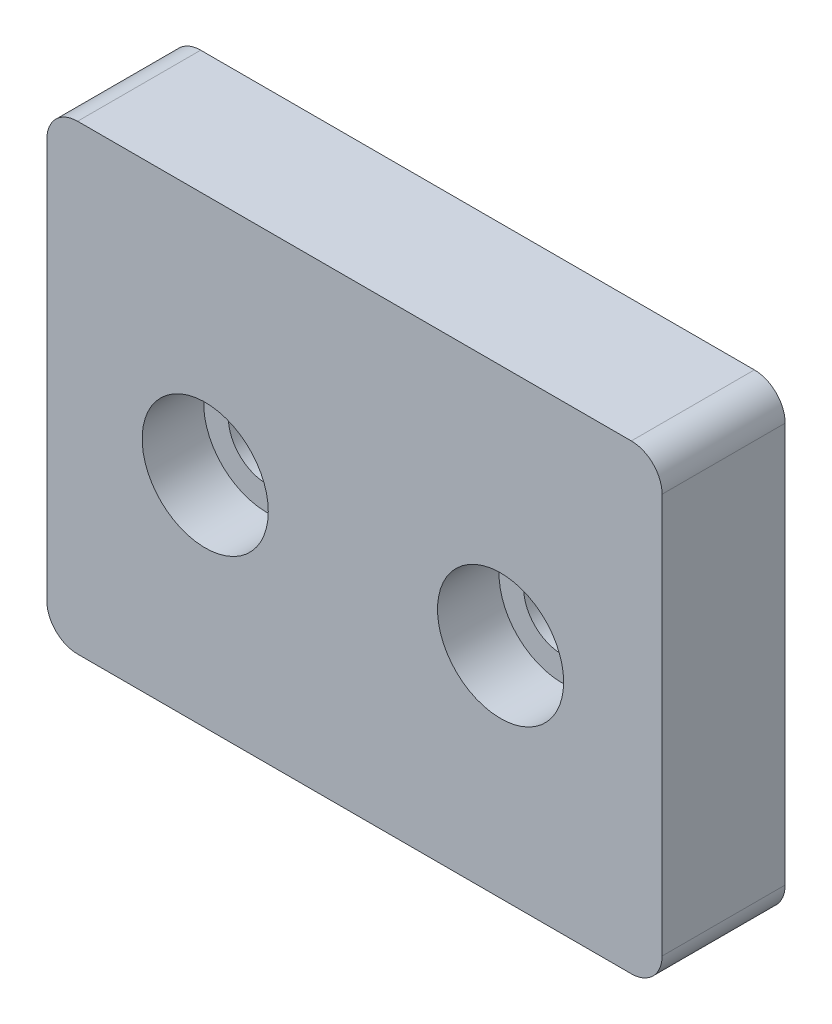
ISO-10303-21;
HEADER;
FILE_DESCRIPTION(('STEP AP214'),'2;1');
FILE_NAME('part.step','',(''),(''),'','','');
FILE_SCHEMA(('AUTOMOTIVE_DESIGN { 1 0 10303 214 1 1 1 1 }'));
ENDSEC;
DATA;
#1=APPLICATION_CONTEXT('core data for automotive mechanical design processes');
#2=APPLICATION_PROTOCOL_DEFINITION('international standard','automotive_design',2000,#1);
#3=PRODUCT_CONTEXT('',#1,'mechanical');
#4=PRODUCT('Part','Part','',(#3));
#5=PRODUCT_RELATED_PRODUCT_CATEGORY('part','',(#4));
#6=PRODUCT_DEFINITION_FORMATION('','',#4);
#7=PRODUCT_DEFINITION_CONTEXT('part definition',#1,'design');
#8=PRODUCT_DEFINITION('design','',#6,#7);
#9=PRODUCT_DEFINITION_SHAPE('','',#8);
#10=(LENGTH_UNIT() NAMED_UNIT(*) SI_UNIT(.MILLI.,.METRE.));
#11=(NAMED_UNIT(*) PLANE_ANGLE_UNIT() SI_UNIT($,.RADIAN.));
#12=(NAMED_UNIT(*) SI_UNIT($,.STERADIAN.) SOLID_ANGLE_UNIT());
#13=UNCERTAINTY_MEASURE_WITH_UNIT(LENGTH_MEASURE(1.E-05),#10,'distance_accuracy_value','');
#14=(GEOMETRIC_REPRESENTATION_CONTEXT(3) GLOBAL_UNCERTAINTY_ASSIGNED_CONTEXT((#13)) GLOBAL_UNIT_ASSIGNED_CONTEXT((#10,
#11,#12)) REPRESENTATION_CONTEXT('',''));
#15=CARTESIAN_POINT('',(0.,0.,0.));
#16=DIRECTION('',(0.,0.,1.));
#17=DIRECTION('',(1.,0.,0.));
#18=AXIS2_PLACEMENT_3D('',#15,#16,#17);
#19=CARTESIAN_POINT('',(4.74874158909593,-1.24229421046024,4.));
#20=DIRECTION('',(0.,0.,-1.));
#21=DIRECTION('',(-1.,0.,0.));
#22=AXIS2_PLACEMENT_3D('',#19,#20,#21);
#23=CYLINDRICAL_SURFACE('',#22,1.25);
#24=CARTESIAN_POINT('',(4.74874158909593,-1.24229421046024,0.));
#25=DIRECTION('',(0.,0.,1.));
#26=DIRECTION('',(1.,0.,0.));
#27=AXIS2_PLACEMENT_3D('',#24,#25,#26);
#28=CIRCLE('',#27,1.25);
#29=CARTESIAN_POINT('',(5.99874158909593,-1.24229421046024,0.));
#30=VERTEX_POINT('',#29);
#31=EDGE_CURVE('E171',#30,#30,#28,.T.);
#32=ORIENTED_EDGE('',*,*,#31,.F.);
#33=EDGE_LOOP('',(#32));
#34=FACE_BOUND('',#33,.T.);
#35=CARTESIAN_POINT('',(4.74874158909593,-1.24229421046024,2.));
#36=DIRECTION('',(0.,0.,1.));
#37=DIRECTION('',(1.,0.,0.));
#38=AXIS2_PLACEMENT_3D('',#35,#36,#37);
#39=CIRCLE('',#38,1.25);
#40=CARTESIAN_POINT('',(5.99874158909593,-1.24229421046024,2.));
#41=VERTEX_POINT('',#40);
#42=EDGE_CURVE('E137',#41,#41,#39,.T.);
#43=ORIENTED_EDGE('',*,*,#42,.T.);
#44=EDGE_LOOP('',(#43));
#45=FACE_BOUND('',#44,.T.);
#46=ADVANCED_FACE('F32',(#34,#45),#23,.F.);
#47=CARTESIAN_POINT('',(-4.85125841090407,-1.24229421046024,4.));
#48=DIRECTION('',(0.,0.,-1.));
#49=DIRECTION('',(-1.,0.,0.));
#50=AXIS2_PLACEMENT_3D('',#47,#48,#49);
#51=CYLINDRICAL_SURFACE('',#50,1.25);
#52=CARTESIAN_POINT('',(-4.85125841090407,-1.24229421046024,0.));
#53=DIRECTION('',(0.,0.,1.));
#54=DIRECTION('',(1.,0.,0.));
#55=AXIS2_PLACEMENT_3D('',#52,#53,#54);
#56=CIRCLE('',#55,1.25);
#57=CARTESIAN_POINT('',(-3.60125841090407,-1.24229421046024,0.));
#58=VERTEX_POINT('',#57);
#59=EDGE_CURVE('E141',#58,#58,#56,.T.);
#60=ORIENTED_EDGE('',*,*,#59,.F.);
#61=EDGE_LOOP('',(#60));
#62=FACE_BOUND('',#61,.T.);
#63=CARTESIAN_POINT('',(-4.85125841090407,-1.24229421046024,2.));
#64=DIRECTION('',(0.,0.,1.));
#65=DIRECTION('',(1.,0.,0.));
#66=AXIS2_PLACEMENT_3D('',#63,#64,#65);
#67=CIRCLE('',#66,1.25);
#68=CARTESIAN_POINT('',(-3.60125841090407,-1.24229421046024,2.));
#69=VERTEX_POINT('',#68);
#70=EDGE_CURVE('E134',#69,#69,#67,.T.);
#71=ORIENTED_EDGE('',*,*,#70,.T.);
#72=EDGE_LOOP('',(#71));
#73=FACE_BOUND('',#72,.T.);
#74=ADVANCED_FACE('F206',(#62,#73),#51,.F.);
#75=CARTESIAN_POINT('',(0.,0.,4.));
#76=DIRECTION('',(0.,0.,-1.));
#77=DIRECTION('',(-1.,0.,0.));
#78=AXIS2_PLACEMENT_3D('',#75,#76,#77);
#79=PLANE('',#78);
#80=CARTESIAN_POINT('',(-4.85125841090407,-1.24229421046024,4.));
#81=DIRECTION('',(0.,0.,1.));
#82=DIRECTION('',(1.,0.,0.));
#83=AXIS2_PLACEMENT_3D('',#80,#81,#82);
#84=CIRCLE('',#83,2.05);
#85=CARTESIAN_POINT('',(-2.80125841090407,-1.24229421046024,4.));
#86=VERTEX_POINT('',#85);
#87=EDGE_CURVE('E189',#86,#86,#84,.T.);
#88=ORIENTED_EDGE('',*,*,#87,.F.);
#89=EDGE_LOOP('',(#88));
#90=FACE_BOUND('',#89,.T.);
#91=CARTESIAN_POINT('',(4.74874158909593,-1.24229421046024,4.));
#92=DIRECTION('',(0.,0.,1.));
#93=DIRECTION('',(1.,0.,0.));
#94=AXIS2_PLACEMENT_3D('',#91,#92,#93);
#95=CIRCLE('',#94,2.05);
#96=CARTESIAN_POINT('',(6.79874158909593,-1.24229421046024,4.));
#97=VERTEX_POINT('',#96);
#98=EDGE_CURVE('E183',#97,#97,#95,.T.);
#99=ORIENTED_EDGE('',*,*,#98,.F.);
#100=EDGE_LOOP('',(#99));
#101=FACE_BOUND('',#100,.T.);
#102=DIRECTION('',(0.,-1.,0.));
#103=VECTOR('',#102,1.);
#104=CARTESIAN_POINT('',(-9.99874158909593,6.64564965687844,4.));
#105=LINE('',#104,#103);
#106=CARTESIAN_POINT('',(-9.99874158909593,5.64564965687844,4.));
#107=VERTEX_POINT('',#106);
#108=CARTESIAN_POINT('',(-9.99874158909593,-7.35435034312156,4.));
#109=VERTEX_POINT('',#108);
#110=EDGE_CURVE('E177',#107,#109,#105,.T.);
#111=ORIENTED_EDGE('',*,*,#110,.T.);
#112=CARTESIAN_POINT('',(-8.99874158909593,-7.35435034312156,4.));
#113=DIRECTION('',(0.,0.,-1.));
#114=DIRECTION('',(-1.,0.,0.));
#115=AXIS2_PLACEMENT_3D('',#112,#113,#114);
#116=CIRCLE('',#115,1.);
#117=CARTESIAN_POINT('',(-8.99874158909593,-8.35435034312156,4.));
#118=VERTEX_POINT('',#117);
#119=EDGE_CURVE('E155',#109,#118,#116,.F.);
#120=ORIENTED_EDGE('',*,*,#119,.T.);
#121=DIRECTION('',(1.,0.,0.));
#122=VECTOR('',#121,1.);
#123=CARTESIAN_POINT('',(9.99874158909593,-8.35435034312156,4.));
#124=LINE('',#123,#122);
#125=CARTESIAN_POINT('',(8.99874158909593,-8.35435034312156,4.));
#126=VERTEX_POINT('',#125);
#127=EDGE_CURVE('E118',#118,#126,#124,.T.);
#128=ORIENTED_EDGE('',*,*,#127,.T.);
#129=CARTESIAN_POINT('',(8.99874158909593,-7.35435034312156,4.));
#130=DIRECTION('',(0.,0.,-1.));
#131=DIRECTION('',(-1.,0.,0.));
#132=AXIS2_PLACEMENT_3D('',#129,#130,#131);
#133=CIRCLE('',#132,1.);
#134=CARTESIAN_POINT('',(9.99874158909593,-7.35435034312156,4.));
#135=VERTEX_POINT('',#134);
#136=EDGE_CURVE('E150',#126,#135,#133,.F.);
#137=ORIENTED_EDGE('',*,*,#136,.T.);
#138=DIRECTION('',(0.,1.,0.));
#139=VECTOR('',#138,1.);
#140=CARTESIAN_POINT('',(9.99874158909593,6.64564965687844,4.));
#141=LINE('',#140,#139);
#142=CARTESIAN_POINT('',(9.99874158909593,5.64564965687844,4.));
#143=VERTEX_POINT('',#142);
#144=EDGE_CURVE('E125',#135,#143,#141,.T.);
#145=ORIENTED_EDGE('',*,*,#144,.T.);
#146=CARTESIAN_POINT('',(8.99874158909593,5.64564965687844,4.));
#147=DIRECTION('',(0.,0.,-1.));
#148=DIRECTION('',(-1.,0.,0.));
#149=AXIS2_PLACEMENT_3D('',#146,#147,#148);
#150=CIRCLE('',#149,1.);
#151=CARTESIAN_POINT('',(8.99874158909593,6.64564965687844,4.));
#152=VERTEX_POINT('',#151);
#153=EDGE_CURVE('E54',#143,#152,#150,.F.);
#154=ORIENTED_EDGE('',*,*,#153,.T.);
#155=DIRECTION('',(-1.,0.,0.));
#156=VECTOR('',#155,1.);
#157=CARTESIAN_POINT('',(9.99874158909593,6.64564965687844,4.));
#158=LINE('',#157,#156);
#159=CARTESIAN_POINT('',(-8.99874158909592,6.64564965687844,4.));
#160=VERTEX_POINT('',#159);
#161=EDGE_CURVE('E128',#152,#160,#158,.T.);
#162=ORIENTED_EDGE('',*,*,#161,.T.);
#163=CARTESIAN_POINT('',(-8.99874158909593,5.64564965687844,4.));
#164=DIRECTION('',(0.,0.,-1.));
#165=DIRECTION('',(-1.,0.,0.));
#166=AXIS2_PLACEMENT_3D('',#163,#164,#165);
#167=CIRCLE('',#166,1.);
#168=EDGE_CURVE('E153',#160,#107,#167,.F.);
#169=ORIENTED_EDGE('',*,*,#168,.T.);
#170=EDGE_LOOP('',(#111,#120,#128,#137,#145,#154,#162,#169));
#171=FACE_BOUND('',#170,.T.);
#172=ADVANCED_FACE('F203',(#90,#101,#171),#79,.F.);
#173=CARTESIAN_POINT('',(0.,0.,0.));
#174=DIRECTION('',(0.,0.,-1.));
#175=DIRECTION('',(-1.,0.,0.));
#176=AXIS2_PLACEMENT_3D('',#173,#174,#175);
#177=PLANE('',#176);
#178=ORIENTED_EDGE('',*,*,#31,.T.);
#179=EDGE_LOOP('',(#178));
#180=FACE_BOUND('',#179,.T.);
#181=DIRECTION('',(1.,0.,0.));
#182=VECTOR('',#181,1.);
#183=CARTESIAN_POINT('',(9.99874158909593,-8.35435034312156,0.));
#184=LINE('',#183,#182);
#185=CARTESIAN_POINT('',(-8.99874158909593,-8.35435034312156,0.));
#186=VERTEX_POINT('',#185);
#187=CARTESIAN_POINT('',(8.99874158909593,-8.35435034312156,0.));
#188=VERTEX_POINT('',#187);
#189=EDGE_CURVE('E115',#186,#188,#184,.T.);
#190=ORIENTED_EDGE('',*,*,#189,.F.);
#191=CARTESIAN_POINT('',(-8.99874158909593,-7.35435034312156,0.));
#192=DIRECTION('',(0.,0.,-1.));
#193=DIRECTION('',(-1.,0.,0.));
#194=AXIS2_PLACEMENT_3D('',#191,#192,#193);
#195=CIRCLE('',#194,1.);
#196=CARTESIAN_POINT('',(-9.99874158909593,-7.35435034312156,0.));
#197=VERTEX_POINT('',#196);
#198=EDGE_CURVE('E98',#186,#197,#195,.T.);
#199=ORIENTED_EDGE('',*,*,#198,.T.);
#200=DIRECTION('',(0.,-1.,0.));
#201=VECTOR('',#200,1.);
#202=CARTESIAN_POINT('',(-9.99874158909593,6.64564965687844,0.));
#203=LINE('',#202,#201);
#204=CARTESIAN_POINT('',(-9.99874158909593,5.64564965687844,0.));
#205=VERTEX_POINT('',#204);
#206=EDGE_CURVE('E126',#205,#197,#203,.T.);
#207=ORIENTED_EDGE('',*,*,#206,.F.);
#208=CARTESIAN_POINT('',(-8.99874158909593,5.64564965687844,0.));
#209=DIRECTION('',(0.,0.,-1.));
#210=DIRECTION('',(-1.,0.,0.));
#211=AXIS2_PLACEMENT_3D('',#208,#209,#210);
#212=CIRCLE('',#211,1.);
#213=CARTESIAN_POINT('',(-8.99874158909592,6.64564965687844,0.));
#214=VERTEX_POINT('',#213);
#215=EDGE_CURVE('E109',#205,#214,#212,.T.);
#216=ORIENTED_EDGE('',*,*,#215,.T.);
#217=DIRECTION('',(-1.,0.,0.));
#218=VECTOR('',#217,1.);
#219=CARTESIAN_POINT('',(9.99874158909593,6.64564965687844,0.));
#220=LINE('',#219,#218);
#221=CARTESIAN_POINT('',(8.99874158909593,6.64564965687844,0.));
#222=VERTEX_POINT('',#221);
#223=EDGE_CURVE('E130',#222,#214,#220,.T.);
#224=ORIENTED_EDGE('',*,*,#223,.F.);
#225=CARTESIAN_POINT('',(8.99874158909593,5.64564965687844,0.));
#226=DIRECTION('',(0.,0.,-1.));
#227=DIRECTION('',(-1.,0.,0.));
#228=AXIS2_PLACEMENT_3D('',#225,#226,#227);
#229=CIRCLE('',#228,1.);
#230=CARTESIAN_POINT('',(9.99874158909593,5.64564965687844,0.));
#231=VERTEX_POINT('',#230);
#232=EDGE_CURVE('E144',#222,#231,#229,.T.);
#233=ORIENTED_EDGE('',*,*,#232,.T.);
#234=DIRECTION('',(0.,1.,0.));
#235=VECTOR('',#234,1.);
#236=CARTESIAN_POINT('',(9.99874158909593,6.64564965687844,0.));
#237=LINE('',#236,#235);
#238=CARTESIAN_POINT('',(9.99874158909593,-7.35435034312156,0.));
#239=VERTEX_POINT('',#238);
#240=EDGE_CURVE('E166',#239,#231,#237,.T.);
#241=ORIENTED_EDGE('',*,*,#240,.F.);
#242=CARTESIAN_POINT('',(8.99874158909593,-7.35435034312156,0.));
#243=DIRECTION('',(0.,0.,-1.));
#244=DIRECTION('',(-1.,0.,0.));
#245=AXIS2_PLACEMENT_3D('',#242,#243,#244);
#246=CIRCLE('',#245,1.);
#247=EDGE_CURVE('E119',#239,#188,#246,.T.);
#248=ORIENTED_EDGE('',*,*,#247,.T.);
#249=EDGE_LOOP('',(#190,#199,#207,#216,#224,#233,#241,#248));
#250=FACE_BOUND('',#249,.T.);
#251=ORIENTED_EDGE('',*,*,#59,.T.);
#252=EDGE_LOOP('',(#251));
#253=FACE_BOUND('',#252,.T.);
#254=ADVANCED_FACE('F122',(#180,#250,#253),#177,.T.);
#255=CARTESIAN_POINT('',(9.99874158909593,6.64564965687844,4.));
#256=DIRECTION('',(-1.,0.,0.));
#257=DIRECTION('',(0.,-1.,0.));
#258=AXIS2_PLACEMENT_3D('',#255,#256,#257);
#259=PLANE('',#258);
#260=ORIENTED_EDGE('',*,*,#240,.T.);
#261=DIRECTION('',(0.,0.,-1.));
#262=VECTOR('',#261,1.);
#263=CARTESIAN_POINT('',(9.99874158909593,5.64564965687844,4.));
#264=LINE('',#263,#262);
#265=EDGE_CURVE('E11',#231,#143,#264,.F.);
#266=ORIENTED_EDGE('',*,*,#265,.T.);
#267=ORIENTED_EDGE('',*,*,#144,.F.);
#268=DIRECTION('',(0.,0.,-1.));
#269=VECTOR('',#268,1.);
#270=CARTESIAN_POINT('',(9.99874158909593,-7.35435034312156,4.));
#271=LINE('',#270,#269);
#272=EDGE_CURVE('E40',#135,#239,#271,.T.);
#273=ORIENTED_EDGE('',*,*,#272,.T.);
#274=EDGE_LOOP('',(#260,#266,#267,#273));
#275=FACE_BOUND('',#274,.T.);
#276=ADVANCED_FACE('F165',(#275),#259,.F.);
#277=CARTESIAN_POINT('',(9.99874158909593,6.64564965687844,4.));
#278=DIRECTION('',(0.,-1.,0.));
#279=DIRECTION('',(1.,0.,0.));
#280=AXIS2_PLACEMENT_3D('',#277,#278,#279);
#281=PLANE('',#280);
#282=ORIENTED_EDGE('',*,*,#223,.T.);
#283=DIRECTION('',(0.,0.,-1.));
#284=VECTOR('',#283,1.);
#285=CARTESIAN_POINT('',(-8.99874158909593,6.64564965687844,4.));
#286=LINE('',#285,#284);
#287=EDGE_CURVE('E47',#214,#160,#286,.F.);
#288=ORIENTED_EDGE('',*,*,#287,.T.);
#289=ORIENTED_EDGE('',*,*,#161,.F.);
#290=DIRECTION('',(0.,0.,-1.));
#291=VECTOR('',#290,1.);
#292=CARTESIAN_POINT('',(8.99874158909593,6.64564965687844,4.));
#293=LINE('',#292,#291);
#294=EDGE_CURVE('E157',#152,#222,#293,.T.);
#295=ORIENTED_EDGE('',*,*,#294,.T.);
#296=EDGE_LOOP('',(#282,#288,#289,#295));
#297=FACE_BOUND('',#296,.T.);
#298=ADVANCED_FACE('F216',(#297),#281,.F.);
#299=CARTESIAN_POINT('',(-9.99874158909593,6.64564965687844,4.));
#300=DIRECTION('',(1.,0.,0.));
#301=DIRECTION('',(0.,0.,-1.));
#302=AXIS2_PLACEMENT_3D('',#299,#300,#301);
#303=PLANE('',#302);
#304=ORIENTED_EDGE('',*,*,#206,.T.);
#305=DIRECTION('',(0.,0.,-1.));
#306=VECTOR('',#305,1.);
#307=CARTESIAN_POINT('',(-9.99874158909593,-7.35435034312156,4.));
#308=LINE('',#307,#306);
#309=EDGE_CURVE('E103',#197,#109,#308,.F.);
#310=ORIENTED_EDGE('',*,*,#309,.T.);
#311=ORIENTED_EDGE('',*,*,#110,.F.);
#312=DIRECTION('',(0.,0.,-1.));
#313=VECTOR('',#312,1.);
#314=CARTESIAN_POINT('',(-9.99874158909593,5.64564965687844,4.));
#315=LINE('',#314,#313);
#316=EDGE_CURVE('E108',#107,#205,#315,.T.);
#317=ORIENTED_EDGE('',*,*,#316,.T.);
#318=EDGE_LOOP('',(#304,#310,#311,#317));
#319=FACE_BOUND('',#318,.T.);
#320=ADVANCED_FACE('F213',(#319),#303,.F.);
#321=CARTESIAN_POINT('',(9.99874158909593,-8.35435034312156,4.));
#322=DIRECTION('',(0.,1.,0.));
#323=DIRECTION('',(-1.,0.,0.));
#324=AXIS2_PLACEMENT_3D('',#321,#322,#323);
#325=PLANE('',#324);
#326=ORIENTED_EDGE('',*,*,#127,.F.);
#327=DIRECTION('',(0.,0.,-1.));
#328=VECTOR('',#327,1.);
#329=CARTESIAN_POINT('',(-8.99874158909593,-8.35435034312156,4.));
#330=LINE('',#329,#328);
#331=EDGE_CURVE('E102',#118,#186,#330,.T.);
#332=ORIENTED_EDGE('',*,*,#331,.T.);
#333=ORIENTED_EDGE('',*,*,#189,.T.);
#334=DIRECTION('',(0.,0.,-1.));
#335=VECTOR('',#334,1.);
#336=CARTESIAN_POINT('',(8.99874158909593,-8.35435034312156,4.));
#337=LINE('',#336,#335);
#338=EDGE_CURVE('E120',#188,#126,#337,.F.);
#339=ORIENTED_EDGE('',*,*,#338,.T.);
#340=EDGE_LOOP('',(#326,#332,#333,#339));
#341=FACE_BOUND('',#340,.T.);
#342=ADVANCED_FACE('F114',(#341),#325,.F.);
#343=CARTESIAN_POINT('',(-4.85125841090407,-1.24229421046024,2.));
#344=DIRECTION('',(0.,0.,1.));
#345=DIRECTION('',(1.,0.,0.));
#346=AXIS2_PLACEMENT_3D('',#343,#344,#345);
#347=CYLINDRICAL_SURFACE('',#346,2.05);
#348=CARTESIAN_POINT('',(-4.85125841090407,-1.24229421046024,2.));
#349=DIRECTION('',(0.,0.,1.));
#350=DIRECTION('',(1.,0.,0.));
#351=AXIS2_PLACEMENT_3D('',#348,#349,#350);
#352=CIRCLE('',#351,2.05);
#353=CARTESIAN_POINT('',(-2.80125841090407,-1.24229421046024,2.));
#354=VERTEX_POINT('',#353);
#355=EDGE_CURVE('E138',#354,#354,#352,.T.);
#356=ORIENTED_EDGE('',*,*,#355,.F.);
#357=EDGE_LOOP('',(#356));
#358=FACE_BOUND('',#357,.T.);
#359=ORIENTED_EDGE('',*,*,#87,.T.);
#360=EDGE_LOOP('',(#359));
#361=FACE_BOUND('',#360,.T.);
#362=ADVANCED_FACE('F197',(#358,#361),#347,.F.);
#363=CARTESIAN_POINT('',(-4.85125841090407,-1.24229421046024,2.));
#364=DIRECTION('',(0.,0.,1.));
#365=DIRECTION('',(1.,0.,0.));
#366=AXIS2_PLACEMENT_3D('',#363,#364,#365);
#367=PLANE('',#366);
#368=ORIENTED_EDGE('',*,*,#70,.F.);
#369=EDGE_LOOP('',(#368));
#370=FACE_BOUND('',#369,.T.);
#371=ORIENTED_EDGE('',*,*,#355,.T.);
#372=EDGE_LOOP('',(#371));
#373=FACE_BOUND('',#372,.T.);
#374=ADVANCED_FACE('F195',(#370,#373),#367,.T.);
#375=CARTESIAN_POINT('',(4.74874158909593,-1.24229421046024,2.));
#376=DIRECTION('',(0.,0.,1.));
#377=DIRECTION('',(1.,0.,0.));
#378=AXIS2_PLACEMENT_3D('',#375,#376,#377);
#379=CYLINDRICAL_SURFACE('',#378,2.05);
#380=CARTESIAN_POINT('',(4.74874158909593,-1.24229421046024,2.));
#381=DIRECTION('',(0.,0.,1.));
#382=DIRECTION('',(1.,0.,0.));
#383=AXIS2_PLACEMENT_3D('',#380,#381,#382);
#384=CIRCLE('',#383,2.05);
#385=CARTESIAN_POINT('',(6.79874158909593,-1.24229421046024,2.));
#386=VERTEX_POINT('',#385);
#387=EDGE_CURVE('E186',#386,#386,#384,.T.);
#388=ORIENTED_EDGE('',*,*,#387,.F.);
#389=EDGE_LOOP('',(#388));
#390=FACE_BOUND('',#389,.T.);
#391=ORIENTED_EDGE('',*,*,#98,.T.);
#392=EDGE_LOOP('',(#391));
#393=FACE_BOUND('',#392,.T.);
#394=ADVANCED_FACE('F280',(#390,#393),#379,.F.);
#395=CARTESIAN_POINT('',(4.74874158909593,-1.24229421046024,2.));
#396=DIRECTION('',(0.,0.,1.));
#397=DIRECTION('',(1.,0.,0.));
#398=AXIS2_PLACEMENT_3D('',#395,#396,#397);
#399=PLANE('',#398);
#400=ORIENTED_EDGE('',*,*,#42,.F.);
#401=EDGE_LOOP('',(#400));
#402=FACE_BOUND('',#401,.T.);
#403=ORIENTED_EDGE('',*,*,#387,.T.);
#404=EDGE_LOOP('',(#403));
#405=FACE_BOUND('',#404,.T.);
#406=ADVANCED_FACE('F249',(#402,#405),#399,.T.);
#407=CARTESIAN_POINT('',(-8.99874158909593,-7.35435034312156,4.));
#408=DIRECTION('',(0.,0.,-1.));
#409=DIRECTION('',(-1.,0.,0.));
#410=AXIS2_PLACEMENT_3D('',#407,#408,#409);
#411=CYLINDRICAL_SURFACE('',#410,1.);
#412=ORIENTED_EDGE('',*,*,#119,.F.);
#413=ORIENTED_EDGE('',*,*,#309,.F.);
#414=ORIENTED_EDGE('',*,*,#198,.F.);
#415=ORIENTED_EDGE('',*,*,#331,.F.);
#416=EDGE_LOOP('',(#412,#413,#414,#415));
#417=FACE_BOUND('',#416,.T.);
#418=ADVANCED_FACE('F101',(#417),#411,.T.);
#419=CARTESIAN_POINT('',(-8.99874158909593,5.64564965687844,4.));
#420=DIRECTION('',(0.,0.,-1.));
#421=DIRECTION('',(-1.,0.,0.));
#422=AXIS2_PLACEMENT_3D('',#419,#420,#421);
#423=CYLINDRICAL_SURFACE('',#422,1.);
#424=ORIENTED_EDGE('',*,*,#168,.F.);
#425=ORIENTED_EDGE('',*,*,#287,.F.);
#426=ORIENTED_EDGE('',*,*,#215,.F.);
#427=ORIENTED_EDGE('',*,*,#316,.F.);
#428=EDGE_LOOP('',(#424,#425,#426,#427));
#429=FACE_BOUND('',#428,.T.);
#430=ADVANCED_FACE('F215',(#429),#423,.T.);
#431=CARTESIAN_POINT('',(8.99874158909593,5.64564965687844,4.));
#432=DIRECTION('',(0.,0.,-1.));
#433=DIRECTION('',(-1.,0.,0.));
#434=AXIS2_PLACEMENT_3D('',#431,#432,#433);
#435=CYLINDRICAL_SURFACE('',#434,1.);
#436=ORIENTED_EDGE('',*,*,#153,.F.);
#437=ORIENTED_EDGE('',*,*,#265,.F.);
#438=ORIENTED_EDGE('',*,*,#232,.F.);
#439=ORIENTED_EDGE('',*,*,#294,.F.);
#440=EDGE_LOOP('',(#436,#437,#438,#439));
#441=FACE_BOUND('',#440,.T.);
#442=ADVANCED_FACE('F219',(#441),#435,.T.);
#443=CARTESIAN_POINT('',(8.99874158909593,-7.35435034312156,4.));
#444=DIRECTION('',(0.,0.,-1.));
#445=DIRECTION('',(-1.,0.,0.));
#446=AXIS2_PLACEMENT_3D('',#443,#444,#445);
#447=CYLINDRICAL_SURFACE('',#446,1.);
#448=ORIENTED_EDGE('',*,*,#136,.F.);
#449=ORIENTED_EDGE('',*,*,#338,.F.);
#450=ORIENTED_EDGE('',*,*,#247,.F.);
#451=ORIENTED_EDGE('',*,*,#272,.F.);
#452=EDGE_LOOP('',(#448,#449,#450,#451));
#453=FACE_BOUND('',#452,.T.);
#454=ADVANCED_FACE('F34',(#453),#447,.T.);
#455=CLOSED_SHELL('',(#46,#74,#172,#254,#276,#298,#320,#342,#362,#374,#394,#406,#418,#430,#442,#454));
#456=MANIFOLD_SOLID_BREP('B2',#455);
#457=ADVANCED_BREP_SHAPE_REPRESENTATION('',(#18,#456),#14);
#458=SHAPE_DEFINITION_REPRESENTATION(#9,#457);
ENDSEC;
END-ISO-10303-21;
